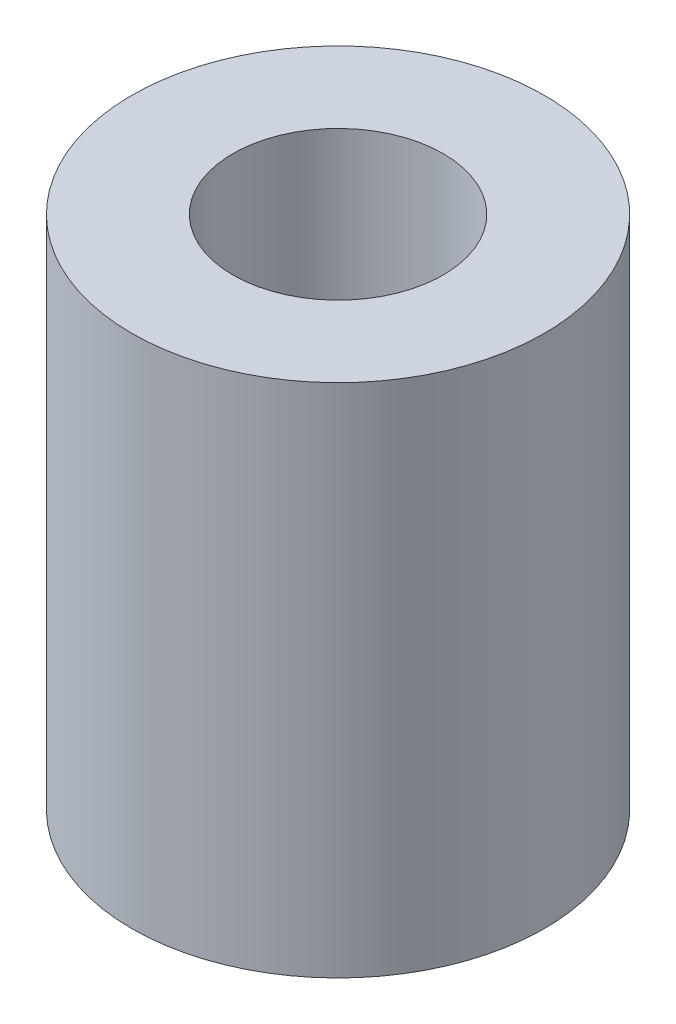
ISO-10303-21;
HEADER;
FILE_DESCRIPTION(('STEP AP214'),'2;1');
FILE_NAME('part.step','',(''),(''),'','','');
FILE_SCHEMA(('AUTOMOTIVE_DESIGN { 1 0 10303 214 1 1 1 1 }'));
ENDSEC;
DATA;
#1=APPLICATION_CONTEXT('core data for automotive mechanical design processes');
#2=APPLICATION_PROTOCOL_DEFINITION('international standard','automotive_design',2000,#1);
#3=PRODUCT_CONTEXT('',#1,'mechanical');
#4=PRODUCT('Part','Part','',(#3));
#5=PRODUCT_RELATED_PRODUCT_CATEGORY('part','',(#4));
#6=PRODUCT_DEFINITION_FORMATION('','',#4);
#7=PRODUCT_DEFINITION_CONTEXT('part definition',#1,'design');
#8=PRODUCT_DEFINITION('design','',#6,#7);
#9=PRODUCT_DEFINITION_SHAPE('','',#8);
#10=(LENGTH_UNIT() NAMED_UNIT(*) SI_UNIT(.MILLI.,.METRE.));
#11=(NAMED_UNIT(*) PLANE_ANGLE_UNIT() SI_UNIT($,.RADIAN.));
#12=(NAMED_UNIT(*) SI_UNIT($,.STERADIAN.) SOLID_ANGLE_UNIT());
#13=UNCERTAINTY_MEASURE_WITH_UNIT(LENGTH_MEASURE(1.E-05),#10,'distance_accuracy_value','');
#14=(GEOMETRIC_REPRESENTATION_CONTEXT(3) GLOBAL_UNCERTAINTY_ASSIGNED_CONTEXT((#13)) GLOBAL_UNIT_ASSIGNED_CONTEXT((#10,
#11,#12)) REPRESENTATION_CONTEXT('',''));
#15=CARTESIAN_POINT('',(0.,0.,0.));
#16=DIRECTION('',(0.,0.,1.));
#17=DIRECTION('',(1.,0.,0.));
#18=AXIS2_PLACEMENT_3D('',#15,#16,#17);
#19=CARTESIAN_POINT('',(0.,25.,0.));
#20=DIRECTION('',(0.,-1.,0.));
#21=DIRECTION('',(0.,0.,-1.));
#22=AXIS2_PLACEMENT_3D('',#19,#20,#21);
#23=CYLINDRICAL_SURFACE('',#22,10.);
#24=CARTESIAN_POINT('',(0.,25.,0.));
#25=DIRECTION('',(0.,1.,0.));
#26=DIRECTION('',(0.,0.,1.));
#27=AXIS2_PLACEMENT_3D('',#24,#25,#26);
#28=CIRCLE('',#27,10.);
#29=CARTESIAN_POINT('',(0.,25.,10.));
#30=VERTEX_POINT('',#29);
#31=EDGE_CURVE('E11',#30,#30,#28,.T.);
#32=ORIENTED_EDGE('',*,*,#31,.F.);
#33=EDGE_LOOP('',(#32));
#34=FACE_BOUND('',#33,.T.);
#35=CARTESIAN_POINT('',(0.,0.,0.));
#36=DIRECTION('',(0.,1.,0.));
#37=DIRECTION('',(0.,0.,1.));
#38=AXIS2_PLACEMENT_3D('',#35,#36,#37);
#39=CIRCLE('',#38,10.);
#40=CARTESIAN_POINT('',(0.,0.,10.));
#41=VERTEX_POINT('',#40);
#42=EDGE_CURVE('E42',#41,#41,#39,.T.);
#43=ORIENTED_EDGE('',*,*,#42,.T.);
#44=EDGE_LOOP('',(#43));
#45=FACE_BOUND('',#44,.T.);
#46=ADVANCED_FACE('F39',(#34,#45),#23,.T.);
#47=CARTESIAN_POINT('',(0.,25.,0.));
#48=DIRECTION('',(0.,1.,0.));
#49=DIRECTION('',(0.,0.,1.));
#50=AXIS2_PLACEMENT_3D('',#47,#48,#49);
#51=PLANE('',#50);
#52=CARTESIAN_POINT('',(0.,25.,0.));
#53=DIRECTION('',(0.,1.,0.));
#54=DIRECTION('',(0.,0.,1.));
#55=AXIS2_PLACEMENT_3D('',#52,#53,#54);
#56=CIRCLE('',#55,5.09999999999999);
#57=CARTESIAN_POINT('',(0.,25.,5.09999999999999));
#58=VERTEX_POINT('',#57);
#59=EDGE_CURVE('E58',#58,#58,#56,.T.);
#60=ORIENTED_EDGE('',*,*,#59,.F.);
#61=EDGE_LOOP('',(#60));
#62=FACE_BOUND('',#61,.T.);
#63=ORIENTED_EDGE('',*,*,#31,.T.);
#64=EDGE_LOOP('',(#63));
#65=FACE_BOUND('',#64,.T.);
#66=ADVANCED_FACE('F66',(#62,#65),#51,.T.);
#67=CARTESIAN_POINT('',(0.,0.,0.));
#68=DIRECTION('',(0.,1.,0.));
#69=DIRECTION('',(0.,0.,1.));
#70=AXIS2_PLACEMENT_3D('',#67,#68,#69);
#71=PLANE('',#70);
#72=ORIENTED_EDGE('',*,*,#42,.F.);
#73=EDGE_LOOP('',(#72));
#74=FACE_BOUND('',#73,.T.);
#75=ADVANCED_FACE('F52',(#74),#71,.F.);
#76=CARTESIAN_POINT('',(0.,5.,0.));
#77=DIRECTION('',(0.,1.,0.));
#78=DIRECTION('',(0.,0.,1.));
#79=AXIS2_PLACEMENT_3D('',#76,#77,#78);
#80=CONICAL_SURFACE('',#79,5.1,1.02974425867665);
#81=CARTESIAN_POINT('',(0.,1.93561084295944,0.));
#82=VERTEX_POINT('',#81);
#83=VERTEX_LOOP('',#82);
#84=FACE_BOUND('',#83,.T.);
#85=CARTESIAN_POINT('',(0.,5.,0.));
#86=DIRECTION('',(0.,1.,0.));
#87=DIRECTION('',(0.,0.,1.));
#88=AXIS2_PLACEMENT_3D('',#85,#86,#87);
#89=CIRCLE('',#88,5.1);
#90=CARTESIAN_POINT('',(0.,5.,5.1));
#91=VERTEX_POINT('',#90);
#92=EDGE_CURVE('E56',#91,#91,#89,.T.);
#93=ORIENTED_EDGE('',*,*,#92,.T.);
#94=EDGE_LOOP('',(#93));
#95=FACE_BOUND('',#94,.T.);
#96=ADVANCED_FACE('F48',(#84,#95),#80,.F.);
#97=CARTESIAN_POINT('',(0.,25.,0.));
#98=DIRECTION('',(0.,1.,0.));
#99=DIRECTION('',(0.,0.,1.));
#100=AXIS2_PLACEMENT_3D('',#97,#98,#99);
#101=CYLINDRICAL_SURFACE('',#100,5.09999999999999);
#102=ORIENTED_EDGE('',*,*,#92,.F.);
#103=EDGE_LOOP('',(#102));
#104=FACE_BOUND('',#103,.T.);
#105=ORIENTED_EDGE('',*,*,#59,.T.);
#106=EDGE_LOOP('',(#105));
#107=FACE_BOUND('',#106,.T.);
#108=ADVANCED_FACE('F51',(#104,#107),#101,.F.);
#109=CLOSED_SHELL('',(#46,#66,#75,#96,#108));
#110=MANIFOLD_SOLID_BREP('B2',#109);
#111=ADVANCED_BREP_SHAPE_REPRESENTATION('',(#18,#110),#14);
#112=SHAPE_DEFINITION_REPRESENTATION(#9,#111);
ENDSEC;
END-ISO-10303-21;
